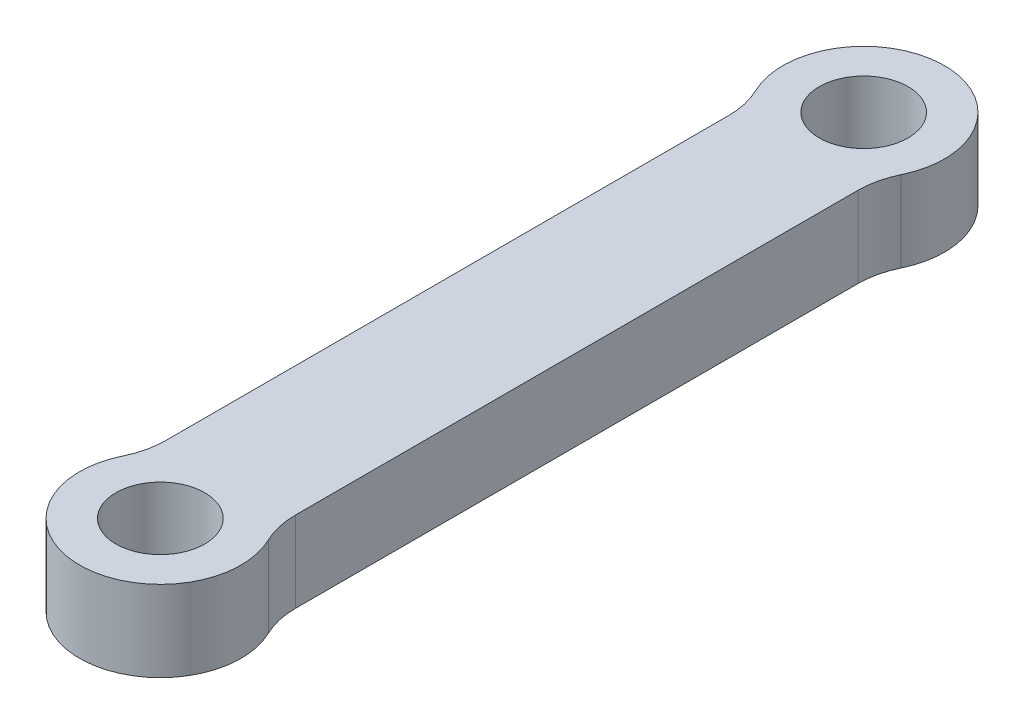
ISO-10303-21;
HEADER;
FILE_DESCRIPTION(('STEP AP214'),'2;1');
FILE_NAME('part.step','',(''),(''),'','','');
FILE_SCHEMA(('AUTOMOTIVE_DESIGN { 1 0 10303 214 1 1 1 1 }'));
ENDSEC;
DATA;
#1=APPLICATION_CONTEXT('core data for automotive mechanical design processes');
#2=APPLICATION_PROTOCOL_DEFINITION('international standard','automotive_design',2000,#1);
#3=PRODUCT_CONTEXT('',#1,'mechanical');
#4=PRODUCT('Part','Part','',(#3));
#5=PRODUCT_RELATED_PRODUCT_CATEGORY('part','',(#4));
#6=PRODUCT_DEFINITION_FORMATION('','',#4);
#7=PRODUCT_DEFINITION_CONTEXT('part definition',#1,'design');
#8=PRODUCT_DEFINITION('design','',#6,#7);
#9=PRODUCT_DEFINITION_SHAPE('','',#8);
#10=(LENGTH_UNIT() NAMED_UNIT(*) SI_UNIT(.MILLI.,.METRE.));
#11=(NAMED_UNIT(*) PLANE_ANGLE_UNIT() SI_UNIT($,.RADIAN.));
#12=(NAMED_UNIT(*) SI_UNIT($,.STERADIAN.) SOLID_ANGLE_UNIT());
#13=UNCERTAINTY_MEASURE_WITH_UNIT(LENGTH_MEASURE(1.E-05),#10,'distance_accuracy_value','');
#14=(GEOMETRIC_REPRESENTATION_CONTEXT(3) GLOBAL_UNCERTAINTY_ASSIGNED_CONTEXT((#13)) GLOBAL_UNIT_ASSIGNED_CONTEXT((#10,
#11,#12)) REPRESENTATION_CONTEXT('',''));
#15=CARTESIAN_POINT('',(0.,0.,0.));
#16=DIRECTION('',(0.,0.,1.));
#17=DIRECTION('',(1.,0.,0.));
#18=AXIS2_PLACEMENT_3D('',#15,#16,#17);
#19=CARTESIAN_POINT('',(-3.99999999999999,5.,21.75));
#20=DIRECTION('',(1.,0.,0.));
#21=DIRECTION('',(0.,0.,-1.));
#22=AXIS2_PLACEMENT_3D('',#19,#20,#21);
#23=PLANE('',#22);
#24=DIRECTION('',(0.,0.,1.));
#25=VECTOR('',#24,1.);
#26=CARTESIAN_POINT('',(-3.99999999999999,0.,21.75));
#27=LINE('',#26,#25);
#28=CARTESIAN_POINT('',(-3.99999999999999,0.,-17.3911010564593));
#29=VERTEX_POINT('',#28);
#30=CARTESIAN_POINT('',(-3.99999999999999,0.,17.3911010564593));
#31=VERTEX_POINT('',#30);
#32=EDGE_CURVE('E113',#29,#31,#27,.T.);
#33=ORIENTED_EDGE('',*,*,#32,.T.);
#34=DIRECTION('',(0.,1.,0.));
#35=VECTOR('',#34,1.);
#36=CARTESIAN_POINT('',(-3.99999999999999,5.,17.3911010564593));
#37=LINE('',#36,#35);
#38=CARTESIAN_POINT('',(-3.99999999999999,5.,17.3911010564593));
#39=VERTEX_POINT('',#38);
#40=EDGE_CURVE('E118',#31,#39,#37,.T.);
#41=ORIENTED_EDGE('',*,*,#40,.T.);
#42=DIRECTION('',(0.,0.,1.));
#43=VECTOR('',#42,1.);
#44=CARTESIAN_POINT('',(-3.99999999999999,5.,21.75));
#45=LINE('',#44,#43);
#46=CARTESIAN_POINT('',(-3.99999999999999,5.,-17.3911010564593));
#47=VERTEX_POINT('',#46);
#48=EDGE_CURVE('E116',#47,#39,#45,.T.);
#49=ORIENTED_EDGE('',*,*,#48,.F.);
#50=DIRECTION('',(0.,1.,0.));
#51=VECTOR('',#50,1.);
#52=CARTESIAN_POINT('',(-3.99999999999999,5.,-17.3911010564593));
#53=LINE('',#52,#51);
#54=EDGE_CURVE('E105',#47,#29,#53,.F.);
#55=ORIENTED_EDGE('',*,*,#54,.T.);
#56=EDGE_LOOP('',(#33,#41,#49,#55));
#57=FACE_BOUND('',#56,.T.);
#58=ADVANCED_FACE('F38',(#57),#23,.F.);
#59=CARTESIAN_POINT('',(4.,5.,21.75));
#60=DIRECTION('',(-1.,0.,0.));
#61=DIRECTION('',(0.,0.,1.));
#62=AXIS2_PLACEMENT_3D('',#59,#60,#61);
#63=PLANE('',#62);
#64=DIRECTION('',(0.,0.,-1.));
#65=VECTOR('',#64,1.);
#66=CARTESIAN_POINT('',(4.,5.,21.75));
#67=LINE('',#66,#65);
#68=CARTESIAN_POINT('',(4.,5.,17.3911010564593));
#69=VERTEX_POINT('',#68);
#70=CARTESIAN_POINT('',(4.,5.,-17.3911010564593));
#71=VERTEX_POINT('',#70);
#72=EDGE_CURVE('E119',#69,#71,#67,.T.);
#73=ORIENTED_EDGE('',*,*,#72,.F.);
#74=DIRECTION('',(0.,1.,0.));
#75=VECTOR('',#74,1.);
#76=CARTESIAN_POINT('',(4.,5.,17.3911010564593));
#77=LINE('',#76,#75);
#78=CARTESIAN_POINT('',(4.,0.,17.3911010564593));
#79=VERTEX_POINT('',#78);
#80=EDGE_CURVE('E154',#69,#79,#77,.F.);
#81=ORIENTED_EDGE('',*,*,#80,.T.);
#82=DIRECTION('',(0.,0.,-1.));
#83=VECTOR('',#82,1.);
#84=CARTESIAN_POINT('',(4.,0.,21.75));
#85=LINE('',#84,#83);
#86=CARTESIAN_POINT('',(4.,0.,-17.3911010564593));
#87=VERTEX_POINT('',#86);
#88=EDGE_CURVE('E128',#79,#87,#85,.T.);
#89=ORIENTED_EDGE('',*,*,#88,.T.);
#90=DIRECTION('',(0.,1.,0.));
#91=VECTOR('',#90,1.);
#92=CARTESIAN_POINT('',(4.,5.,-17.3911010564593));
#93=LINE('',#92,#91);
#94=EDGE_CURVE('E150',#87,#71,#93,.T.);
#95=ORIENTED_EDGE('',*,*,#94,.T.);
#96=EDGE_LOOP('',(#73,#81,#89,#95));
#97=FACE_BOUND('',#96,.T.);
#98=ADVANCED_FACE('F184',(#97),#63,.F.);
#99=CARTESIAN_POINT('',(0.,5.,-21.75));
#100=DIRECTION('',(0.,1.,0.));
#101=DIRECTION('',(0.,0.,1.));
#102=AXIS2_PLACEMENT_3D('',#99,#100,#101);
#103=PLANE('',#102);
#104=CARTESIAN_POINT('',(0.,5.,-21.75));
#105=DIRECTION('',(0.,1.,0.));
#106=DIRECTION('',(0.,0.,1.));
#107=AXIS2_PLACEMENT_3D('',#104,#105,#106);
#108=CIRCLE('',#107,5.);
#109=CARTESIAN_POINT('',(4.5,5.,-19.5705505282296));
#110=VERTEX_POINT('',#109);
#111=CARTESIAN_POINT('',(-4.5,5.,-19.5705505282296));
#112=VERTEX_POINT('',#111);
#113=EDGE_CURVE('E192',#110,#112,#108,.T.);
#114=ORIENTED_EDGE('',*,*,#113,.T.);
#115=CARTESIAN_POINT('',(-8.99999999999999,5.,-17.3911010564593));
#116=DIRECTION('',(0.,1.,0.));
#117=DIRECTION('',(0.,0.,1.));
#118=AXIS2_PLACEMENT_3D('',#115,#116,#117);
#119=CIRCLE('',#118,5.);
#120=EDGE_CURVE('E11',#112,#47,#119,.F.);
#121=ORIENTED_EDGE('',*,*,#120,.T.);
#122=ORIENTED_EDGE('',*,*,#48,.T.);
#123=CARTESIAN_POINT('',(-8.99999999999999,5.,17.3911010564593));
#124=DIRECTION('',(0.,1.,0.));
#125=DIRECTION('',(0.,0.,1.));
#126=AXIS2_PLACEMENT_3D('',#123,#124,#125);
#127=CIRCLE('',#126,5.);
#128=CARTESIAN_POINT('',(-4.5,5.,19.5705505282296));
#129=VERTEX_POINT('',#128);
#130=EDGE_CURVE('E162',#39,#129,#127,.F.);
#131=ORIENTED_EDGE('',*,*,#130,.T.);
#132=CARTESIAN_POINT('',(0.,5.,21.75));
#133=DIRECTION('',(0.,1.,0.));
#134=DIRECTION('',(0.,0.,-1.));
#135=AXIS2_PLACEMENT_3D('',#132,#133,#134);
#136=CIRCLE('',#135,5.);
#137=CARTESIAN_POINT('',(4.5,5.,19.5705505282296));
#138=VERTEX_POINT('',#137);
#139=EDGE_CURVE('E202',#129,#138,#136,.T.);
#140=ORIENTED_EDGE('',*,*,#139,.T.);
#141=CARTESIAN_POINT('',(9.,5.,17.3911010564593));
#142=DIRECTION('',(0.,1.,0.));
#143=DIRECTION('',(0.,0.,1.));
#144=AXIS2_PLACEMENT_3D('',#141,#142,#143);
#145=CIRCLE('',#144,5.);
#146=EDGE_CURVE('E170',#138,#69,#145,.F.);
#147=ORIENTED_EDGE('',*,*,#146,.T.);
#148=ORIENTED_EDGE('',*,*,#72,.T.);
#149=CARTESIAN_POINT('',(9.,5.,-17.3911010564593));
#150=DIRECTION('',(0.,1.,0.));
#151=DIRECTION('',(0.,0.,1.));
#152=AXIS2_PLACEMENT_3D('',#149,#150,#151);
#153=CIRCLE('',#152,5.);
#154=EDGE_CURVE('E173',#71,#110,#153,.F.);
#155=ORIENTED_EDGE('',*,*,#154,.T.);
#156=EDGE_LOOP('',(#114,#121,#122,#131,#140,#147,#148,#155));
#157=FACE_BOUND('',#156,.T.);
#158=CARTESIAN_POINT('',(0.,5.,-21.75));
#159=DIRECTION('',(0.,1.,0.));
#160=DIRECTION('',(0.,0.,1.));
#161=AXIS2_PLACEMENT_3D('',#158,#159,#160);
#162=CIRCLE('',#161,2.75);
#163=CARTESIAN_POINT('',(0.,5.,-19.));
#164=VERTEX_POINT('',#163);
#165=EDGE_CURVE('E137',#164,#164,#162,.T.);
#166=ORIENTED_EDGE('',*,*,#165,.F.);
#167=EDGE_LOOP('',(#166));
#168=FACE_BOUND('',#167,.T.);
#169=CARTESIAN_POINT('',(0.,5.,21.75));
#170=DIRECTION('',(0.,1.,0.));
#171=DIRECTION('',(0.,0.,1.));
#172=AXIS2_PLACEMENT_3D('',#169,#170,#171);
#173=CIRCLE('',#172,2.75);
#174=CARTESIAN_POINT('',(0.,5.,24.5));
#175=VERTEX_POINT('',#174);
#176=EDGE_CURVE('E200',#175,#175,#173,.T.);
#177=ORIENTED_EDGE('',*,*,#176,.F.);
#178=EDGE_LOOP('',(#177));
#179=FACE_BOUND('',#178,.T.);
#180=ADVANCED_FACE('F190',(#157,#168,#179),#103,.T.);
#181=CARTESIAN_POINT('',(0.,0.,-21.75));
#182=DIRECTION('',(0.,1.,0.));
#183=DIRECTION('',(0.,0.,1.));
#184=AXIS2_PLACEMENT_3D('',#181,#182,#183);
#185=PLANE('',#184);
#186=ORIENTED_EDGE('',*,*,#88,.F.);
#187=CARTESIAN_POINT('',(9.,0.,17.3911010564593));
#188=DIRECTION('',(0.,1.,0.));
#189=DIRECTION('',(0.,0.,1.));
#190=AXIS2_PLACEMENT_3D('',#187,#188,#189);
#191=CIRCLE('',#190,5.);
#192=CARTESIAN_POINT('',(4.5,0.,19.5705505282296));
#193=VERTEX_POINT('',#192);
#194=EDGE_CURVE('E167',#79,#193,#191,.T.);
#195=ORIENTED_EDGE('',*,*,#194,.T.);
#196=CARTESIAN_POINT('',(0.,0.,21.75));
#197=DIRECTION('',(0.,1.,0.));
#198=DIRECTION('',(0.,0.,1.));
#199=AXIS2_PLACEMENT_3D('',#196,#197,#198);
#200=CIRCLE('',#199,5.);
#201=CARTESIAN_POINT('',(-4.5,0.,19.5705505282296));
#202=VERTEX_POINT('',#201);
#203=EDGE_CURVE('E195',#193,#202,#200,.F.);
#204=ORIENTED_EDGE('',*,*,#203,.T.);
#205=CARTESIAN_POINT('',(-8.99999999999999,0.,17.3911010564593));
#206=DIRECTION('',(0.,1.,0.));
#207=DIRECTION('',(0.,0.,1.));
#208=AXIS2_PLACEMENT_3D('',#205,#206,#207);
#209=CIRCLE('',#208,5.);
#210=EDGE_CURVE('E126',#202,#31,#209,.T.);
#211=ORIENTED_EDGE('',*,*,#210,.T.);
#212=ORIENTED_EDGE('',*,*,#32,.F.);
#213=CARTESIAN_POINT('',(-8.99999999999999,0.,-17.3911010564593));
#214=DIRECTION('',(0.,1.,0.));
#215=DIRECTION('',(0.,0.,1.));
#216=AXIS2_PLACEMENT_3D('',#213,#214,#215);
#217=CIRCLE('',#216,5.);
#218=CARTESIAN_POINT('',(-4.5,0.,-19.5705505282296));
#219=VERTEX_POINT('',#218);
#220=EDGE_CURVE('E47',#29,#219,#217,.T.);
#221=ORIENTED_EDGE('',*,*,#220,.T.);
#222=CARTESIAN_POINT('',(0.,0.,-21.75));
#223=DIRECTION('',(0.,1.,0.));
#224=DIRECTION('',(0.,0.,1.));
#225=AXIS2_PLACEMENT_3D('',#222,#223,#224);
#226=CIRCLE('',#225,5.);
#227=CARTESIAN_POINT('',(4.5,0.,-19.5705505282296));
#228=VERTEX_POINT('',#227);
#229=EDGE_CURVE('E179',#219,#228,#226,.F.);
#230=ORIENTED_EDGE('',*,*,#229,.T.);
#231=CARTESIAN_POINT('',(9.,0.,-17.3911010564593));
#232=DIRECTION('',(0.,1.,0.));
#233=DIRECTION('',(0.,0.,1.));
#234=AXIS2_PLACEMENT_3D('',#231,#232,#233);
#235=CIRCLE('',#234,5.);
#236=EDGE_CURVE('E108',#228,#87,#235,.T.);
#237=ORIENTED_EDGE('',*,*,#236,.T.);
#238=EDGE_LOOP('',(#186,#195,#204,#211,#212,#221,#230,#237));
#239=FACE_BOUND('',#238,.T.);
#240=CARTESIAN_POINT('',(0.,0.,-21.75));
#241=DIRECTION('',(0.,1.,0.));
#242=DIRECTION('',(0.,0.,1.));
#243=AXIS2_PLACEMENT_3D('',#240,#241,#242);
#244=CIRCLE('',#243,2.75);
#245=CARTESIAN_POINT('',(0.,0.,-19.));
#246=VERTEX_POINT('',#245);
#247=EDGE_CURVE('E129',#246,#246,#244,.T.);
#248=ORIENTED_EDGE('',*,*,#247,.T.);
#249=EDGE_LOOP('',(#248));
#250=FACE_BOUND('',#249,.T.);
#251=CARTESIAN_POINT('',(0.,0.,21.75));
#252=DIRECTION('',(0.,1.,0.));
#253=DIRECTION('',(0.,0.,1.));
#254=AXIS2_PLACEMENT_3D('',#251,#252,#253);
#255=CIRCLE('',#254,2.75);
#256=CARTESIAN_POINT('',(0.,0.,24.5));
#257=VERTEX_POINT('',#256);
#258=EDGE_CURVE('E209',#257,#257,#255,.T.);
#259=ORIENTED_EDGE('',*,*,#258,.T.);
#260=EDGE_LOOP('',(#259));
#261=FACE_BOUND('',#260,.T.);
#262=ADVANCED_FACE('F122',(#239,#250,#261),#185,.F.);
#263=CARTESIAN_POINT('',(0.,0.,21.75));
#264=DIRECTION('',(0.,1.,0.));
#265=DIRECTION('',(0.,0.,1.));
#266=AXIS2_PLACEMENT_3D('',#263,#264,#265);
#267=CYLINDRICAL_SURFACE('',#266,2.75);
#268=ORIENTED_EDGE('',*,*,#258,.F.);
#269=EDGE_LOOP('',(#268));
#270=FACE_BOUND('',#269,.T.);
#271=ORIENTED_EDGE('',*,*,#176,.T.);
#272=EDGE_LOOP('',(#271));
#273=FACE_BOUND('',#272,.T.);
#274=ADVANCED_FACE('F262',(#270,#273),#267,.F.);
#275=CARTESIAN_POINT('',(0.,0.,-21.75));
#276=DIRECTION('',(0.,1.,0.));
#277=DIRECTION('',(0.,0.,1.));
#278=AXIS2_PLACEMENT_3D('',#275,#276,#277);
#279=CYLINDRICAL_SURFACE('',#278,2.75);
#280=ORIENTED_EDGE('',*,*,#247,.F.);
#281=EDGE_LOOP('',(#280));
#282=FACE_BOUND('',#281,.T.);
#283=ORIENTED_EDGE('',*,*,#165,.T.);
#284=EDGE_LOOP('',(#283));
#285=FACE_BOUND('',#284,.T.);
#286=ADVANCED_FACE('F267',(#282,#285),#279,.F.);
#287=CARTESIAN_POINT('',(0.,-14.142135623731,-21.75));
#288=DIRECTION('',(0.,1.,0.));
#289=DIRECTION('',(0.,0.,1.));
#290=AXIS2_PLACEMENT_3D('',#287,#288,#289);
#291=CYLINDRICAL_SURFACE('',#290,5.);
#292=ORIENTED_EDGE('',*,*,#113,.F.);
#293=DIRECTION('',(0.,1.,0.));
#294=VECTOR('',#293,1.);
#295=CARTESIAN_POINT('',(4.5,-14.142135623731,-19.5705505282296));
#296=LINE('',#295,#294);
#297=EDGE_CURVE('E54',#110,#228,#296,.F.);
#298=ORIENTED_EDGE('',*,*,#297,.T.);
#299=ORIENTED_EDGE('',*,*,#229,.F.);
#300=DIRECTION('',(0.,1.,0.));
#301=VECTOR('',#300,1.);
#302=CARTESIAN_POINT('',(-4.5,-14.142135623731,-19.5705505282296));
#303=LINE('',#302,#301);
#304=EDGE_CURVE('E106',#219,#112,#303,.T.);
#305=ORIENTED_EDGE('',*,*,#304,.T.);
#306=EDGE_LOOP('',(#292,#298,#299,#305));
#307=FACE_BOUND('',#306,.T.);
#308=ADVANCED_FACE('F193',(#307),#291,.T.);
#309=CARTESIAN_POINT('',(0.,-14.142135623731,21.75));
#310=DIRECTION('',(0.,1.,0.));
#311=DIRECTION('',(0.,0.,1.));
#312=AXIS2_PLACEMENT_3D('',#309,#310,#311);
#313=CYLINDRICAL_SURFACE('',#312,5.);
#314=ORIENTED_EDGE('',*,*,#139,.F.);
#315=DIRECTION('',(0.,1.,0.));
#316=VECTOR('',#315,1.);
#317=CARTESIAN_POINT('',(-4.5,-14.142135623731,19.5705505282296));
#318=LINE('',#317,#316);
#319=EDGE_CURVE('E147',#129,#202,#318,.F.);
#320=ORIENTED_EDGE('',*,*,#319,.T.);
#321=ORIENTED_EDGE('',*,*,#203,.F.);
#322=DIRECTION('',(0.,1.,0.));
#323=VECTOR('',#322,1.);
#324=CARTESIAN_POINT('',(4.5,-14.142135623731,19.5705505282296));
#325=LINE('',#324,#323);
#326=EDGE_CURVE('E144',#193,#138,#325,.T.);
#327=ORIENTED_EDGE('',*,*,#326,.T.);
#328=EDGE_LOOP('',(#314,#320,#321,#327));
#329=FACE_BOUND('',#328,.T.);
#330=ADVANCED_FACE('F238',(#329),#313,.T.);
#331=CARTESIAN_POINT('',(-8.99999999999999,-14.142135623731,17.3911010564593));
#332=DIRECTION('',(0.,1.,0.));
#333=DIRECTION('',(0.,0.,1.));
#334=AXIS2_PLACEMENT_3D('',#331,#332,#333);
#335=CYLINDRICAL_SURFACE('',#334,5.);
#336=ORIENTED_EDGE('',*,*,#210,.F.);
#337=ORIENTED_EDGE('',*,*,#319,.F.);
#338=ORIENTED_EDGE('',*,*,#130,.F.);
#339=ORIENTED_EDGE('',*,*,#40,.F.);
#340=EDGE_LOOP('',(#336,#337,#338,#339));
#341=FACE_BOUND('',#340,.T.);
#342=ADVANCED_FACE('F242',(#341),#335,.F.);
#343=CARTESIAN_POINT('',(9.,-14.142135623731,17.3911010564593));
#344=DIRECTION('',(0.,1.,0.));
#345=DIRECTION('',(0.,0.,1.));
#346=AXIS2_PLACEMENT_3D('',#343,#344,#345);
#347=CYLINDRICAL_SURFACE('',#346,5.);
#348=ORIENTED_EDGE('',*,*,#146,.F.);
#349=ORIENTED_EDGE('',*,*,#326,.F.);
#350=ORIENTED_EDGE('',*,*,#194,.F.);
#351=ORIENTED_EDGE('',*,*,#80,.F.);
#352=EDGE_LOOP('',(#348,#349,#350,#351));
#353=FACE_BOUND('',#352,.T.);
#354=ADVANCED_FACE('F244',(#353),#347,.F.);
#355=CARTESIAN_POINT('',(9.,-14.142135623731,-17.3911010564593));
#356=DIRECTION('',(0.,1.,0.));
#357=DIRECTION('',(0.,0.,1.));
#358=AXIS2_PLACEMENT_3D('',#355,#356,#357);
#359=CYLINDRICAL_SURFACE('',#358,5.);
#360=ORIENTED_EDGE('',*,*,#236,.F.);
#361=ORIENTED_EDGE('',*,*,#297,.F.);
#362=ORIENTED_EDGE('',*,*,#154,.F.);
#363=ORIENTED_EDGE('',*,*,#94,.F.);
#364=EDGE_LOOP('',(#360,#361,#362,#363));
#365=FACE_BOUND('',#364,.T.);
#366=ADVANCED_FACE('F187',(#365),#359,.F.);
#367=CARTESIAN_POINT('',(-8.99999999999999,-14.142135623731,-17.3911010564593));
#368=DIRECTION('',(0.,1.,0.));
#369=DIRECTION('',(0.,0.,1.));
#370=AXIS2_PLACEMENT_3D('',#367,#368,#369);
#371=CYLINDRICAL_SURFACE('',#370,5.);
#372=ORIENTED_EDGE('',*,*,#120,.F.);
#373=ORIENTED_EDGE('',*,*,#304,.F.);
#374=ORIENTED_EDGE('',*,*,#220,.F.);
#375=ORIENTED_EDGE('',*,*,#54,.F.);
#376=EDGE_LOOP('',(#372,#373,#374,#375));
#377=FACE_BOUND('',#376,.T.);
#378=ADVANCED_FACE('F40',(#377),#371,.F.);
#379=CLOSED_SHELL('',(#58,#98,#180,#262,#274,#286,#308,#330,#342,#354,#366,#378));
#380=MANIFOLD_SOLID_BREP('B2',#379);
#381=ADVANCED_BREP_SHAPE_REPRESENTATION('',(#18,#380),#14);
#382=SHAPE_DEFINITION_REPRESENTATION(#9,#381);
ENDSEC;
END-ISO-10303-21;
